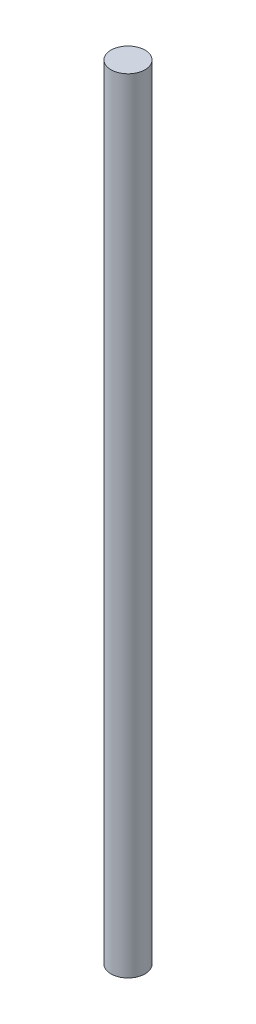
ISO-10303-21;
HEADER;
FILE_DESCRIPTION(('STEP AP214'),'2;1');
FILE_NAME('part.step','',(''),(''),'','','');
FILE_SCHEMA(('AUTOMOTIVE_DESIGN { 1 0 10303 214 1 1 1 1 }'));
ENDSEC;
DATA;
#1=APPLICATION_CONTEXT('core data for automotive mechanical design processes');
#2=APPLICATION_PROTOCOL_DEFINITION('international standard','automotive_design',2000,#1);
#3=PRODUCT_CONTEXT('',#1,'mechanical');
#4=PRODUCT('Part','Part','',(#3));
#5=PRODUCT_RELATED_PRODUCT_CATEGORY('part','',(#4));
#6=PRODUCT_DEFINITION_FORMATION('','',#4);
#7=PRODUCT_DEFINITION_CONTEXT('part definition',#1,'design');
#8=PRODUCT_DEFINITION('design','',#6,#7);
#9=PRODUCT_DEFINITION_SHAPE('','',#8);
#10=(LENGTH_UNIT() NAMED_UNIT(*) SI_UNIT(.MILLI.,.METRE.));
#11=(NAMED_UNIT(*) PLANE_ANGLE_UNIT() SI_UNIT($,.RADIAN.));
#12=(NAMED_UNIT(*) SI_UNIT($,.STERADIAN.) SOLID_ANGLE_UNIT());
#13=UNCERTAINTY_MEASURE_WITH_UNIT(LENGTH_MEASURE(1.E-05),#10,'distance_accuracy_value','');
#14=(GEOMETRIC_REPRESENTATION_CONTEXT(3) GLOBAL_UNCERTAINTY_ASSIGNED_CONTEXT((#13)) GLOBAL_UNIT_ASSIGNED_CONTEXT((#10,
#11,#12)) REPRESENTATION_CONTEXT('',''));
#15=CARTESIAN_POINT('',(0.,0.,0.));
#16=DIRECTION('',(0.,0.,1.));
#17=DIRECTION('',(1.,0.,0.));
#18=AXIS2_PLACEMENT_3D('',#15,#16,#17);
#19=CARTESIAN_POINT('',(0.,146.05,0.));
#20=DIRECTION('',(0.,-1.,0.));
#21=DIRECTION('',(0.,0.,-1.));
#22=AXIS2_PLACEMENT_3D('',#19,#20,#21);
#23=CYLINDRICAL_SURFACE('',#22,3.175);
#24=CARTESIAN_POINT('',(0.,146.05,0.));
#25=DIRECTION('',(0.,1.,0.));
#26=DIRECTION('',(0.,0.,1.));
#27=AXIS2_PLACEMENT_3D('',#24,#25,#26);
#28=CIRCLE('',#27,3.175);
#29=CARTESIAN_POINT('',(0.,146.05,3.175));
#30=VERTEX_POINT('',#29);
#31=EDGE_CURVE('E10',#30,#30,#28,.T.);
#32=ORIENTED_EDGE('',*,*,#31,.F.);
#33=EDGE_LOOP('',(#32));
#34=FACE_BOUND('',#33,.T.);
#35=CARTESIAN_POINT('',(0.,0.,0.));
#36=DIRECTION('',(0.,1.,0.));
#37=DIRECTION('',(0.,0.,1.));
#38=AXIS2_PLACEMENT_3D('',#35,#36,#37);
#39=CIRCLE('',#38,3.175);
#40=CARTESIAN_POINT('',(0.,0.,3.175));
#41=VERTEX_POINT('',#40);
#42=EDGE_CURVE('E44',#41,#41,#39,.T.);
#43=ORIENTED_EDGE('',*,*,#42,.T.);
#44=EDGE_LOOP('',(#43));
#45=FACE_BOUND('',#44,.T.);
#46=ADVANCED_FACE('F41',(#34,#45),#23,.T.);
#47=CARTESIAN_POINT('',(0.,146.05,0.));
#48=DIRECTION('',(0.,1.,0.));
#49=DIRECTION('',(0.,0.,1.));
#50=AXIS2_PLACEMENT_3D('',#47,#48,#49);
#51=PLANE('',#50);
#52=ORIENTED_EDGE('',*,*,#31,.T.);
#53=EDGE_LOOP('',(#52));
#54=FACE_BOUND('',#53,.T.);
#55=ADVANCED_FACE('F58',(#54),#51,.T.);
#56=CARTESIAN_POINT('',(0.,0.,0.));
#57=DIRECTION('',(0.,1.,0.));
#58=DIRECTION('',(0.,0.,1.));
#59=AXIS2_PLACEMENT_3D('',#56,#57,#58);
#60=PLANE('',#59);
#61=ORIENTED_EDGE('',*,*,#42,.F.);
#62=EDGE_LOOP('',(#61));
#63=FACE_BOUND('',#62,.T.);
#64=ADVANCED_FACE('F56',(#63),#60,.F.);
#65=CLOSED_SHELL('',(#46,#55,#64));
#66=MANIFOLD_SOLID_BREP('B2',#65);
#67=ADVANCED_BREP_SHAPE_REPRESENTATION('',(#18,#66),#14);
#68=SHAPE_DEFINITION_REPRESENTATION(#9,#67);
ENDSEC;
END-ISO-10303-21;
